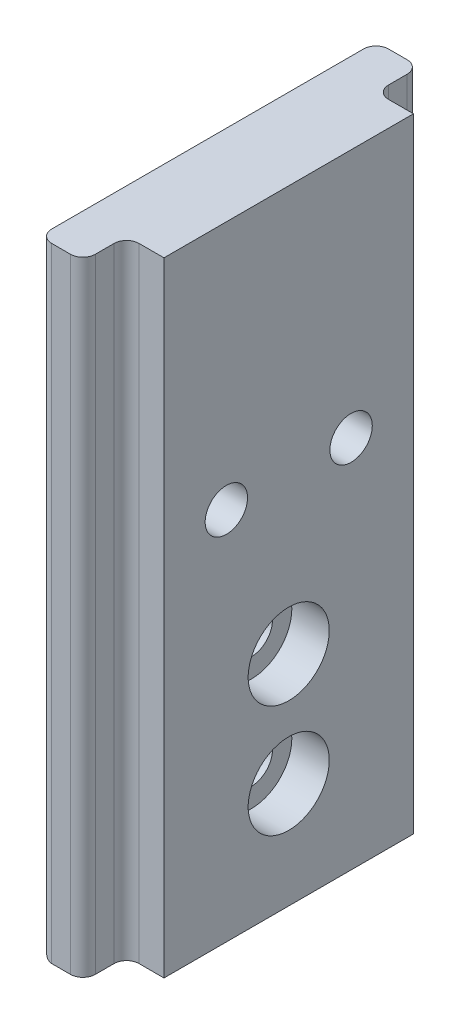
ISO-10303-21;
HEADER;
FILE_DESCRIPTION(('STEP AP214'),'2;1');
FILE_NAME('part.step','',(''),(''),'','','');
FILE_SCHEMA(('AUTOMOTIVE_DESIGN { 1 0 10303 214 1 1 1 1 }'));
ENDSEC;
DATA;
#1=APPLICATION_CONTEXT('core data for automotive mechanical design processes');
#2=APPLICATION_PROTOCOL_DEFINITION('international standard','automotive_design',2000,#1);
#3=PRODUCT_CONTEXT('',#1,'mechanical');
#4=PRODUCT('Part','Part','',(#3));
#5=PRODUCT_RELATED_PRODUCT_CATEGORY('part','',(#4));
#6=PRODUCT_DEFINITION_FORMATION('','',#4);
#7=PRODUCT_DEFINITION_CONTEXT('part definition',#1,'design');
#8=PRODUCT_DEFINITION('design','',#6,#7);
#9=PRODUCT_DEFINITION_SHAPE('','',#8);
#10=(LENGTH_UNIT() NAMED_UNIT(*) SI_UNIT(.MILLI.,.METRE.));
#11=(NAMED_UNIT(*) PLANE_ANGLE_UNIT() SI_UNIT($,.RADIAN.));
#12=(NAMED_UNIT(*) SI_UNIT($,.STERADIAN.) SOLID_ANGLE_UNIT());
#13=UNCERTAINTY_MEASURE_WITH_UNIT(LENGTH_MEASURE(1.E-05),#10,'distance_accuracy_value','');
#14=(GEOMETRIC_REPRESENTATION_CONTEXT(3) GLOBAL_UNCERTAINTY_ASSIGNED_CONTEXT((#13)) GLOBAL_UNIT_ASSIGNED_CONTEXT((#10,
#11,#12)) REPRESENTATION_CONTEXT('',''));
#15=CARTESIAN_POINT('',(0.,0.,0.));
#16=DIRECTION('',(0.,0.,1.));
#17=DIRECTION('',(1.,0.,0.));
#18=AXIS2_PLACEMENT_3D('',#15,#16,#17);
#19=CARTESIAN_POINT('',(0.,0.,0.));
#20=DIRECTION('',(1.,0.,0.));
#21=DIRECTION('',(0.,0.,-1.));
#22=AXIS2_PLACEMENT_3D('',#19,#20,#21);
#23=PLANE('',#22);
#24=CARTESIAN_POINT('',(0.,0.,-5.));
#25=DIRECTION('',(1.,0.,0.));
#26=DIRECTION('',(0.,0.,-1.));
#27=AXIS2_PLACEMENT_3D('',#24,#25,#26);
#28=CIRCLE('',#27,1.7);
#29=CARTESIAN_POINT('',(0.,0.,-6.7));
#30=VERTEX_POINT('',#29);
#31=EDGE_CURVE('E43',#30,#30,#28,.F.);
#32=ORIENTED_EDGE('',*,*,#31,.T.);
#33=EDGE_LOOP('',(#32));
#34=FACE_BOUND('',#33,.T.);
#35=CARTESIAN_POINT('',(0.,0.,4.99999999999999));
#36=DIRECTION('',(1.,0.,0.));
#37=DIRECTION('',(0.,0.,-1.));
#38=AXIS2_PLACEMENT_3D('',#35,#36,#37);
#39=CIRCLE('',#38,1.7);
#40=CARTESIAN_POINT('',(0.,0.,3.3));
#41=VERTEX_POINT('',#40);
#42=EDGE_CURVE('E187',#41,#41,#39,.F.);
#43=ORIENTED_EDGE('',*,*,#42,.T.);
#44=EDGE_LOOP('',(#43));
#45=FACE_BOUND('',#44,.T.);
#46=DIRECTION('',(0.,1.,0.));
#47=VECTOR('',#46,1.);
#48=CARTESIAN_POINT('',(0.,-30.,10.));
#49=LINE('',#48,#47);
#50=CARTESIAN_POINT('',(0.,-30.,10.));
#51=VERTEX_POINT('',#50);
#52=CARTESIAN_POINT('',(0.,20.,10.));
#53=VERTEX_POINT('',#52);
#54=EDGE_CURVE('E228',#51,#53,#49,.T.);
#55=ORIENTED_EDGE('',*,*,#54,.F.);
#56=DIRECTION('',(0.,0.,-1.));
#57=VECTOR('',#56,1.);
#58=CARTESIAN_POINT('',(0.,-30.,-10.));
#59=LINE('',#58,#57);
#60=CARTESIAN_POINT('',(0.,-30.,-10.));
#61=VERTEX_POINT('',#60);
#62=EDGE_CURVE('E234',#51,#61,#59,.T.);
#63=ORIENTED_EDGE('',*,*,#62,.T.);
#64=DIRECTION('',(0.,1.,0.));
#65=VECTOR('',#64,1.);
#66=CARTESIAN_POINT('',(0.,-30.,-10.));
#67=LINE('',#66,#65);
#68=CARTESIAN_POINT('',(0.,20.,-10.));
#69=VERTEX_POINT('',#68);
#70=EDGE_CURVE('E64',#61,#69,#67,.T.);
#71=ORIENTED_EDGE('',*,*,#70,.T.);
#72=DIRECTION('',(0.,0.,-1.));
#73=VECTOR('',#72,1.);
#74=CARTESIAN_POINT('',(0.,20.,-10.));
#75=LINE('',#74,#73);
#76=EDGE_CURVE('E248',#53,#69,#75,.T.);
#77=ORIENTED_EDGE('',*,*,#76,.F.);
#78=EDGE_LOOP('',(#55,#63,#71,#77));
#79=FACE_BOUND('',#78,.T.);
#80=CARTESIAN_POINT('',(0.,-12.5,0.));
#81=DIRECTION('',(1.,0.,0.));
#82=DIRECTION('',(0.,0.,-1.));
#83=AXIS2_PLACEMENT_3D('',#80,#81,#82);
#84=CIRCLE('',#83,3.25);
#85=CARTESIAN_POINT('',(0.,-12.5,-3.25));
#86=VERTEX_POINT('',#85);
#87=EDGE_CURVE('E286',#86,#86,#84,.T.);
#88=ORIENTED_EDGE('',*,*,#87,.F.);
#89=EDGE_LOOP('',(#88));
#90=FACE_BOUND('',#89,.T.);
#91=CARTESIAN_POINT('',(0.,-21.5,0.));
#92=DIRECTION('',(1.,0.,0.));
#93=DIRECTION('',(0.,0.,-1.));
#94=AXIS2_PLACEMENT_3D('',#91,#92,#93);
#95=CIRCLE('',#94,3.25);
#96=CARTESIAN_POINT('',(0.,-21.5,-3.25));
#97=VERTEX_POINT('',#96);
#98=EDGE_CURVE('E274',#97,#97,#95,.T.);
#99=ORIENTED_EDGE('',*,*,#98,.F.);
#100=EDGE_LOOP('',(#99));
#101=FACE_BOUND('',#100,.T.);
#102=ADVANCED_FACE('F39',(#34,#45,#79,#90,#101),#23,.T.);
#103=CARTESIAN_POINT('',(0.,-21.5,0.));
#104=DIRECTION('',(1.,0.,0.));
#105=DIRECTION('',(0.,0.,-1.));
#106=AXIS2_PLACEMENT_3D('',#103,#104,#105);
#107=CYLINDRICAL_SURFACE('',#106,1.70000000000001);
#108=CARTESIAN_POINT('',(-6.50000000000001,-21.5,0.));
#109=DIRECTION('',(1.,0.,0.));
#110=DIRECTION('',(0.,0.,-1.));
#111=AXIS2_PLACEMENT_3D('',#108,#109,#110);
#112=CIRCLE('',#111,1.7);
#113=CARTESIAN_POINT('',(-6.50000000000001,-21.5,-1.7));
#114=VERTEX_POINT('',#113);
#115=EDGE_CURVE('E265',#114,#114,#112,.T.);
#116=ORIENTED_EDGE('',*,*,#115,.F.);
#117=EDGE_LOOP('',(#116));
#118=FACE_BOUND('',#117,.T.);
#119=CARTESIAN_POINT('',(-3.,-21.5,0.));
#120=DIRECTION('',(1.,0.,0.));
#121=DIRECTION('',(0.,0.,-1.));
#122=AXIS2_PLACEMENT_3D('',#119,#120,#121);
#123=CIRCLE('',#122,1.70000000000001);
#124=CARTESIAN_POINT('',(-3.,-21.5,-1.70000000000001));
#125=VERTEX_POINT('',#124);
#126=EDGE_CURVE('E268',#125,#125,#123,.T.);
#127=ORIENTED_EDGE('',*,*,#126,.T.);
#128=EDGE_LOOP('',(#127));
#129=FACE_BOUND('',#128,.T.);
#130=ADVANCED_FACE('F324',(#118,#129),#107,.F.);
#131=CARTESIAN_POINT('',(-3.,-19.8,0.));
#132=DIRECTION('',(-1.,0.,0.));
#133=DIRECTION('',(0.,0.,1.));
#134=AXIS2_PLACEMENT_3D('',#131,#132,#133);
#135=PLANE('',#134);
#136=ORIENTED_EDGE('',*,*,#126,.F.);
#137=EDGE_LOOP('',(#136));
#138=FACE_BOUND('',#137,.T.);
#139=CARTESIAN_POINT('',(-3.,-21.5,0.));
#140=DIRECTION('',(1.,0.,0.));
#141=DIRECTION('',(0.,0.,-1.));
#142=AXIS2_PLACEMENT_3D('',#139,#140,#141);
#143=CIRCLE('',#142,3.25);
#144=CARTESIAN_POINT('',(-3.,-21.5,-3.25));
#145=VERTEX_POINT('',#144);
#146=EDGE_CURVE('E271',#145,#145,#143,.T.);
#147=ORIENTED_EDGE('',*,*,#146,.T.);
#148=EDGE_LOOP('',(#147));
#149=FACE_BOUND('',#148,.T.);
#150=ADVANCED_FACE('F326',(#138,#149),#135,.F.);
#151=CARTESIAN_POINT('',(0.,-21.5,0.));
#152=DIRECTION('',(1.,0.,0.));
#153=DIRECTION('',(0.,0.,-1.));
#154=AXIS2_PLACEMENT_3D('',#151,#152,#153);
#155=CYLINDRICAL_SURFACE('',#154,3.25);
#156=ORIENTED_EDGE('',*,*,#146,.F.);
#157=EDGE_LOOP('',(#156));
#158=FACE_BOUND('',#157,.T.);
#159=ORIENTED_EDGE('',*,*,#98,.T.);
#160=EDGE_LOOP('',(#159));
#161=FACE_BOUND('',#160,.T.);
#162=ADVANCED_FACE('F333',(#158,#161),#155,.F.);
#163=CARTESIAN_POINT('',(0.,-12.5,0.));
#164=DIRECTION('',(1.,0.,0.));
#165=DIRECTION('',(0.,0.,-1.));
#166=AXIS2_PLACEMENT_3D('',#163,#164,#165);
#167=CYLINDRICAL_SURFACE('',#166,1.70000000000001);
#168=CARTESIAN_POINT('',(-6.50000000000001,-12.5,0.));
#169=DIRECTION('',(1.,0.,0.));
#170=DIRECTION('',(0.,0.,-1.));
#171=AXIS2_PLACEMENT_3D('',#168,#169,#170);
#172=CIRCLE('',#171,1.7);
#173=CARTESIAN_POINT('',(-6.50000000000001,-12.5,-1.7));
#174=VERTEX_POINT('',#173);
#175=EDGE_CURVE('E277',#174,#174,#172,.T.);
#176=ORIENTED_EDGE('',*,*,#175,.F.);
#177=EDGE_LOOP('',(#176));
#178=FACE_BOUND('',#177,.T.);
#179=CARTESIAN_POINT('',(-3.,-12.5,0.));
#180=DIRECTION('',(1.,0.,0.));
#181=DIRECTION('',(0.,0.,-1.));
#182=AXIS2_PLACEMENT_3D('',#179,#180,#181);
#183=CIRCLE('',#182,1.70000000000001);
#184=CARTESIAN_POINT('',(-3.,-12.5,-1.70000000000001));
#185=VERTEX_POINT('',#184);
#186=EDGE_CURVE('E280',#185,#185,#183,.T.);
#187=ORIENTED_EDGE('',*,*,#186,.T.);
#188=EDGE_LOOP('',(#187));
#189=FACE_BOUND('',#188,.T.);
#190=ADVANCED_FACE('F344',(#178,#189),#167,.F.);
#191=CARTESIAN_POINT('',(-3.,-10.8,0.));
#192=DIRECTION('',(-1.,0.,0.));
#193=DIRECTION('',(0.,0.,1.));
#194=AXIS2_PLACEMENT_3D('',#191,#192,#193);
#195=PLANE('',#194);
#196=ORIENTED_EDGE('',*,*,#186,.F.);
#197=EDGE_LOOP('',(#196));
#198=FACE_BOUND('',#197,.T.);
#199=CARTESIAN_POINT('',(-3.,-12.5,0.));
#200=DIRECTION('',(1.,0.,0.));
#201=DIRECTION('',(0.,0.,-1.));
#202=AXIS2_PLACEMENT_3D('',#199,#200,#201);
#203=CIRCLE('',#202,3.25);
#204=CARTESIAN_POINT('',(-3.,-12.5,-3.25));
#205=VERTEX_POINT('',#204);
#206=EDGE_CURVE('E283',#205,#205,#203,.T.);
#207=ORIENTED_EDGE('',*,*,#206,.T.);
#208=EDGE_LOOP('',(#207));
#209=FACE_BOUND('',#208,.T.);
#210=ADVANCED_FACE('F348',(#198,#209),#195,.F.);
#211=CARTESIAN_POINT('',(0.,-12.5,0.));
#212=DIRECTION('',(1.,0.,0.));
#213=DIRECTION('',(0.,0.,-1.));
#214=AXIS2_PLACEMENT_3D('',#211,#212,#213);
#215=CYLINDRICAL_SURFACE('',#214,3.25);
#216=ORIENTED_EDGE('',*,*,#206,.F.);
#217=EDGE_LOOP('',(#216));
#218=FACE_BOUND('',#217,.T.);
#219=ORIENTED_EDGE('',*,*,#87,.T.);
#220=EDGE_LOOP('',(#219));
#221=FACE_BOUND('',#220,.T.);
#222=ADVANCED_FACE('F352',(#218,#221),#215,.F.);
#223=CARTESIAN_POINT('',(-6.5,0.,4.99999999999999));
#224=DIRECTION('',(-1.,0.,0.));
#225=DIRECTION('',(0.,0.,1.));
#226=AXIS2_PLACEMENT_3D('',#223,#224,#225);
#227=CYLINDRICAL_SURFACE('',#226,3.25);
#228=CARTESIAN_POINT('',(-3.5,0.,4.99999999999999));
#229=DIRECTION('',(-1.,0.,0.));
#230=DIRECTION('',(0.,0.,1.));
#231=AXIS2_PLACEMENT_3D('',#228,#229,#230);
#232=CIRCLE('',#231,3.25);
#233=CARTESIAN_POINT('',(-3.5,0.,8.24999999999999));
#234=VERTEX_POINT('',#233);
#235=EDGE_CURVE('E292',#234,#234,#232,.T.);
#236=ORIENTED_EDGE('',*,*,#235,.F.);
#237=EDGE_LOOP('',(#236));
#238=FACE_BOUND('',#237,.T.);
#239=CARTESIAN_POINT('',(-6.5,0.,4.99999999999999));
#240=DIRECTION('',(-1.,0.,0.));
#241=DIRECTION('',(0.,0.,1.));
#242=AXIS2_PLACEMENT_3D('',#239,#240,#241);
#243=CIRCLE('',#242,3.25);
#244=CARTESIAN_POINT('',(-6.5,0.,8.24999999999999));
#245=VERTEX_POINT('',#244);
#246=EDGE_CURVE('E295',#245,#245,#243,.T.);
#247=ORIENTED_EDGE('',*,*,#246,.T.);
#248=EDGE_LOOP('',(#247));
#249=FACE_BOUND('',#248,.T.);
#250=ADVANCED_FACE('F356',(#238,#249),#227,.F.);
#251=CARTESIAN_POINT('',(-3.5,1.7,4.99999999999999));
#252=DIRECTION('',(1.,0.,0.));
#253=DIRECTION('',(0.,0.,-1.));
#254=AXIS2_PLACEMENT_3D('',#251,#252,#253);
#255=PLANE('',#254);
#256=CARTESIAN_POINT('',(-3.5,0.,4.99999999999999));
#257=DIRECTION('',(-1.,0.,0.));
#258=DIRECTION('',(0.,0.,1.));
#259=AXIS2_PLACEMENT_3D('',#256,#257,#258);
#260=CIRCLE('',#259,1.7);
#261=CARTESIAN_POINT('',(-3.5,0.,6.69999999999999));
#262=VERTEX_POINT('',#261);
#263=EDGE_CURVE('E289',#262,#262,#260,.T.);
#264=ORIENTED_EDGE('',*,*,#263,.F.);
#265=EDGE_LOOP('',(#264));
#266=FACE_BOUND('',#265,.T.);
#267=ORIENTED_EDGE('',*,*,#235,.T.);
#268=EDGE_LOOP('',(#267));
#269=FACE_BOUND('',#268,.T.);
#270=ADVANCED_FACE('F358',(#266,#269),#255,.F.);
#271=CARTESIAN_POINT('',(-6.5,0.,4.99999999999999));
#272=DIRECTION('',(-1.,0.,0.));
#273=DIRECTION('',(0.,0.,1.));
#274=AXIS2_PLACEMENT_3D('',#271,#272,#273);
#275=CYLINDRICAL_SURFACE('',#274,1.7);
#276=ORIENTED_EDGE('',*,*,#263,.T.);
#277=EDGE_LOOP('',(#276));
#278=FACE_BOUND('',#277,.T.);
#279=ORIENTED_EDGE('',*,*,#42,.F.);
#280=EDGE_LOOP('',(#279));
#281=FACE_BOUND('',#280,.T.);
#282=ADVANCED_FACE('F361',(#278,#281),#275,.F.);
#283=CARTESIAN_POINT('',(-6.5,0.,-5.));
#284=DIRECTION('',(-1.,0.,0.));
#285=DIRECTION('',(0.,0.,1.));
#286=AXIS2_PLACEMENT_3D('',#283,#284,#285);
#287=CYLINDRICAL_SURFACE('',#286,3.25);
#288=CARTESIAN_POINT('',(-3.5,0.,-5.));
#289=DIRECTION('',(-1.,0.,0.));
#290=DIRECTION('',(0.,0.,1.));
#291=AXIS2_PLACEMENT_3D('',#288,#289,#290);
#292=CIRCLE('',#291,3.25);
#293=CARTESIAN_POINT('',(-3.5,0.,-1.75));
#294=VERTEX_POINT('',#293);
#295=EDGE_CURVE('E181',#294,#294,#292,.T.);
#296=ORIENTED_EDGE('',*,*,#295,.F.);
#297=EDGE_LOOP('',(#296));
#298=FACE_BOUND('',#297,.T.);
#299=CARTESIAN_POINT('',(-6.5,0.,-5.));
#300=DIRECTION('',(-1.,0.,0.));
#301=DIRECTION('',(0.,0.,1.));
#302=AXIS2_PLACEMENT_3D('',#299,#300,#301);
#303=CIRCLE('',#302,3.25);
#304=CARTESIAN_POINT('',(-6.5,0.,-1.75));
#305=VERTEX_POINT('',#304);
#306=EDGE_CURVE('E178',#305,#305,#303,.T.);
#307=ORIENTED_EDGE('',*,*,#306,.T.);
#308=EDGE_LOOP('',(#307));
#309=FACE_BOUND('',#308,.T.);
#310=ADVANCED_FACE('F319',(#298,#309),#287,.F.);
#311=CARTESIAN_POINT('',(-3.5,1.7,-5.));
#312=DIRECTION('',(1.,0.,0.));
#313=DIRECTION('',(0.,0.,-1.));
#314=AXIS2_PLACEMENT_3D('',#311,#312,#313);
#315=PLANE('',#314);
#316=CARTESIAN_POINT('',(-3.5,0.,-5.));
#317=DIRECTION('',(-1.,0.,0.));
#318=DIRECTION('',(0.,0.,1.));
#319=AXIS2_PLACEMENT_3D('',#316,#317,#318);
#320=CIRCLE('',#319,1.7);
#321=CARTESIAN_POINT('',(-3.5,0.,-3.3));
#322=VERTEX_POINT('',#321);
#323=EDGE_CURVE('E298',#322,#322,#320,.T.);
#324=ORIENTED_EDGE('',*,*,#323,.F.);
#325=EDGE_LOOP('',(#324));
#326=FACE_BOUND('',#325,.T.);
#327=ORIENTED_EDGE('',*,*,#295,.T.);
#328=EDGE_LOOP('',(#327));
#329=FACE_BOUND('',#328,.T.);
#330=ADVANCED_FACE('F311',(#326,#329),#315,.F.);
#331=CARTESIAN_POINT('',(-6.5,0.,-5.));
#332=DIRECTION('',(-1.,0.,0.));
#333=DIRECTION('',(0.,0.,1.));
#334=AXIS2_PLACEMENT_3D('',#331,#332,#333);
#335=CYLINDRICAL_SURFACE('',#334,1.7);
#336=ORIENTED_EDGE('',*,*,#323,.T.);
#337=EDGE_LOOP('',(#336));
#338=FACE_BOUND('',#337,.T.);
#339=ORIENTED_EDGE('',*,*,#31,.F.);
#340=EDGE_LOOP('',(#339));
#341=FACE_BOUND('',#340,.T.);
#342=ADVANCED_FACE('F309',(#338,#341),#335,.F.);
#343=CARTESIAN_POINT('',(-5.5,-29.,-13.5));
#344=DIRECTION('',(0.,0.,-1.));
#345=DIRECTION('',(-1.,0.,0.));
#346=AXIS2_PLACEMENT_3D('',#343,#344,#345);
#347=CYLINDRICAL_SURFACE('',#346,1.);
#348=CARTESIAN_POINT('',(-5.5,-29.,-12.5));
#349=DIRECTION('',(0.,0.707106781186547,-0.707106781186547));
#350=DIRECTION('',(0.,0.707106781186547,0.707106781186547));
#351=AXIS2_PLACEMENT_3D('',#348,#349,#350);
#352=ELLIPSE('',#351,1.41421356237309,1.);
#353=CARTESIAN_POINT('',(-6.5,-29.,-12.5));
#354=VERTEX_POINT('',#353);
#355=CARTESIAN_POINT('',(-5.5,-30.,-13.5));
#356=VERTEX_POINT('',#355);
#357=EDGE_CURVE('E48',#354,#356,#352,.F.);
#358=ORIENTED_EDGE('',*,*,#357,.T.);
#359=DIRECTION('',(0.,0.,1.));
#360=VECTOR('',#359,1.);
#361=CARTESIAN_POINT('',(-5.5,-30.,-13.5));
#362=LINE('',#361,#360);
#363=CARTESIAN_POINT('',(-5.50000000000001,-30.,13.5));
#364=VERTEX_POINT('',#363);
#365=EDGE_CURVE('E144',#364,#356,#362,.F.);
#366=ORIENTED_EDGE('',*,*,#365,.F.);
#367=CARTESIAN_POINT('',(-5.50000000000001,-29.,12.5));
#368=DIRECTION('',(0.,-0.707106781186547,-0.707106781186547));
#369=DIRECTION('',(0.,0.707106781186547,-0.707106781186547));
#370=AXIS2_PLACEMENT_3D('',#367,#368,#369);
#371=ELLIPSE('',#370,1.41421356237309,1.);
#372=CARTESIAN_POINT('',(-6.50000000000001,-29.,12.5));
#373=VERTEX_POINT('',#372);
#374=EDGE_CURVE('E11',#373,#364,#371,.F.);
#375=ORIENTED_EDGE('',*,*,#374,.F.);
#376=DIRECTION('',(0.,0.,1.));
#377=VECTOR('',#376,1.);
#378=CARTESIAN_POINT('',(-6.50000000000001,-29.,13.5));
#379=LINE('',#378,#377);
#380=EDGE_CURVE('E177',#354,#373,#379,.T.);
#381=ORIENTED_EDGE('',*,*,#380,.F.);
#382=EDGE_LOOP('',(#358,#366,#375,#381));
#383=FACE_BOUND('',#382,.T.);
#384=ADVANCED_FACE('F176',(#383),#347,.T.);
#385=CARTESIAN_POINT('',(-5.5,-30.,-12.5));
#386=DIRECTION('',(0.,1.,0.));
#387=DIRECTION('',(0.,0.,1.));
#388=AXIS2_PLACEMENT_3D('',#385,#386,#387);
#389=CYLINDRICAL_SURFACE('',#388,1.);
#390=CARTESIAN_POINT('',(-5.5,20.,-12.5));
#391=DIRECTION('',(0.,1.,0.));
#392=DIRECTION('',(0.,0.,1.));
#393=AXIS2_PLACEMENT_3D('',#390,#391,#392);
#394=CIRCLE('',#393,1.);
#395=CARTESIAN_POINT('',(-5.5,20.,-13.5));
#396=VERTEX_POINT('',#395);
#397=CARTESIAN_POINT('',(-6.5,20.,-12.5));
#398=VERTEX_POINT('',#397);
#399=EDGE_CURVE('E173',#396,#398,#394,.T.);
#400=ORIENTED_EDGE('',*,*,#399,.F.);
#401=DIRECTION('',(0.,1.,0.));
#402=VECTOR('',#401,1.);
#403=CARTESIAN_POINT('',(-5.5,-30.,-13.5));
#404=LINE('',#403,#402);
#405=EDGE_CURVE('E161',#356,#396,#404,.T.);
#406=ORIENTED_EDGE('',*,*,#405,.F.);
#407=ORIENTED_EDGE('',*,*,#357,.F.);
#408=DIRECTION('',(0.,1.,0.));
#409=VECTOR('',#408,1.);
#410=CARTESIAN_POINT('',(-6.5,-30.,-12.5));
#411=LINE('',#410,#409);
#412=EDGE_CURVE('E221',#398,#354,#411,.F.);
#413=ORIENTED_EDGE('',*,*,#412,.F.);
#414=EDGE_LOOP('',(#400,#406,#407,#413));
#415=FACE_BOUND('',#414,.T.);
#416=ADVANCED_FACE('F170',(#415),#389,.T.);
#417=CARTESIAN_POINT('',(-3.,-30.,-13.5));
#418=DIRECTION('',(0.,0.,-1.));
#419=DIRECTION('',(-1.,0.,0.));
#420=AXIS2_PLACEMENT_3D('',#417,#418,#419);
#421=PLANE('',#420);
#422=DIRECTION('',(-1.,0.,0.));
#423=VECTOR('',#422,1.);
#424=CARTESIAN_POINT('',(-3.,20.,-13.5));
#425=LINE('',#424,#423);
#426=CARTESIAN_POINT('',(-4.,20.,-13.5));
#427=VERTEX_POINT('',#426);
#428=EDGE_CURVE('E260',#427,#396,#425,.T.);
#429=ORIENTED_EDGE('',*,*,#428,.F.);
#430=DIRECTION('',(0.,1.,0.));
#431=VECTOR('',#430,1.);
#432=CARTESIAN_POINT('',(-4.,-30.,-13.5));
#433=LINE('',#432,#431);
#434=CARTESIAN_POINT('',(-4.,-30.,-13.5));
#435=VERTEX_POINT('',#434);
#436=EDGE_CURVE('E164',#427,#435,#433,.F.);
#437=ORIENTED_EDGE('',*,*,#436,.T.);
#438=DIRECTION('',(-1.,0.,0.));
#439=VECTOR('',#438,1.);
#440=CARTESIAN_POINT('',(-3.,-30.,-13.5));
#441=LINE('',#440,#439);
#442=EDGE_CURVE('E147',#435,#356,#441,.T.);
#443=ORIENTED_EDGE('',*,*,#442,.T.);
#444=ORIENTED_EDGE('',*,*,#405,.T.);
#445=EDGE_LOOP('',(#429,#437,#443,#444));
#446=FACE_BOUND('',#445,.T.);
#447=ADVANCED_FACE('F160',(#446),#421,.T.);
#448=CARTESIAN_POINT('',(-4.,-30.,-12.5));
#449=DIRECTION('',(0.,1.,0.));
#450=DIRECTION('',(0.,0.,1.));
#451=AXIS2_PLACEMENT_3D('',#448,#449,#450);
#452=CYLINDRICAL_SURFACE('',#451,1.);
#453=CARTESIAN_POINT('',(-4.,-30.,-12.5));
#454=DIRECTION('',(0.,1.,0.));
#455=DIRECTION('',(0.,0.,1.));
#456=AXIS2_PLACEMENT_3D('',#453,#454,#455);
#457=CIRCLE('',#456,1.);
#458=CARTESIAN_POINT('',(-3.,-30.,-12.5));
#459=VERTEX_POINT('',#458);
#460=EDGE_CURVE('E154',#435,#459,#457,.F.);
#461=ORIENTED_EDGE('',*,*,#460,.F.);
#462=ORIENTED_EDGE('',*,*,#436,.F.);
#463=CARTESIAN_POINT('',(-4.,20.,-12.5));
#464=DIRECTION('',(0.,1.,0.));
#465=DIRECTION('',(0.,0.,1.));
#466=AXIS2_PLACEMENT_3D('',#463,#464,#465);
#467=CIRCLE('',#466,1.);
#468=CARTESIAN_POINT('',(-3.,20.,-12.5));
#469=VERTEX_POINT('',#468);
#470=EDGE_CURVE('E212',#469,#427,#467,.T.);
#471=ORIENTED_EDGE('',*,*,#470,.F.);
#472=DIRECTION('',(0.,1.,0.));
#473=VECTOR('',#472,1.);
#474=CARTESIAN_POINT('',(-3.,-30.,-12.5));
#475=LINE('',#474,#473);
#476=EDGE_CURVE('E155',#459,#469,#475,.T.);
#477=ORIENTED_EDGE('',*,*,#476,.F.);
#478=EDGE_LOOP('',(#461,#462,#471,#477));
#479=FACE_BOUND('',#478,.T.);
#480=ADVANCED_FACE('F426',(#479),#452,.T.);
#481=CARTESIAN_POINT('',(-3.,-30.,-10.));
#482=DIRECTION('',(1.,0.,0.));
#483=DIRECTION('',(0.,0.,-1.));
#484=AXIS2_PLACEMENT_3D('',#481,#482,#483);
#485=PLANE('',#484);
#486=DIRECTION('',(0.,0.,-1.));
#487=VECTOR('',#486,1.);
#488=CARTESIAN_POINT('',(-3.,20.,-10.));
#489=LINE('',#488,#487);
#490=CARTESIAN_POINT('',(-3.,20.,-11.));
#491=VERTEX_POINT('',#490);
#492=EDGE_CURVE('E262',#491,#469,#489,.T.);
#493=ORIENTED_EDGE('',*,*,#492,.F.);
#494=DIRECTION('',(0.,1.,0.));
#495=VECTOR('',#494,1.);
#496=CARTESIAN_POINT('',(-3.,-30.,-11.));
#497=LINE('',#496,#495);
#498=CARTESIAN_POINT('',(-3.,-30.,-11.));
#499=VERTEX_POINT('',#498);
#500=EDGE_CURVE('E174',#491,#499,#497,.F.);
#501=ORIENTED_EDGE('',*,*,#500,.T.);
#502=DIRECTION('',(0.,0.,-1.));
#503=VECTOR('',#502,1.);
#504=CARTESIAN_POINT('',(-3.,-30.,-10.));
#505=LINE('',#504,#503);
#506=EDGE_CURVE('E165',#499,#459,#505,.T.);
#507=ORIENTED_EDGE('',*,*,#506,.T.);
#508=ORIENTED_EDGE('',*,*,#476,.T.);
#509=EDGE_LOOP('',(#493,#501,#507,#508));
#510=FACE_BOUND('',#509,.T.);
#511=ADVANCED_FACE('F422',(#510),#485,.T.);
#512=CARTESIAN_POINT('',(-2.,0.,-11.));
#513=DIRECTION('',(0.,-1.,0.));
#514=DIRECTION('',(0.,0.,-1.));
#515=AXIS2_PLACEMENT_3D('',#512,#513,#514);
#516=CYLINDRICAL_SURFACE('',#515,1.);
#517=CARTESIAN_POINT('',(-2.,-30.,-11.));
#518=DIRECTION('',(0.,1.,0.));
#519=DIRECTION('',(0.,0.,1.));
#520=AXIS2_PLACEMENT_3D('',#517,#518,#519);
#521=CIRCLE('',#520,1.);
#522=CARTESIAN_POINT('',(-2.,-30.,-10.));
#523=VERTEX_POINT('',#522);
#524=EDGE_CURVE('E189',#499,#523,#521,.T.);
#525=ORIENTED_EDGE('',*,*,#524,.F.);
#526=ORIENTED_EDGE('',*,*,#500,.F.);
#527=CARTESIAN_POINT('',(-2.,20.,-11.));
#528=DIRECTION('',(0.,1.,0.));
#529=DIRECTION('',(0.,0.,1.));
#530=AXIS2_PLACEMENT_3D('',#527,#528,#529);
#531=CIRCLE('',#530,1.);
#532=CARTESIAN_POINT('',(-2.,20.,-10.));
#533=VERTEX_POINT('',#532);
#534=EDGE_CURVE('E191',#533,#491,#531,.F.);
#535=ORIENTED_EDGE('',*,*,#534,.F.);
#536=DIRECTION('',(0.,1.,0.));
#537=VECTOR('',#536,1.);
#538=CARTESIAN_POINT('',(-2.,20.,-10.));
#539=LINE('',#538,#537);
#540=EDGE_CURVE('E225',#523,#533,#539,.T.);
#541=ORIENTED_EDGE('',*,*,#540,.F.);
#542=EDGE_LOOP('',(#525,#526,#535,#541));
#543=FACE_BOUND('',#542,.T.);
#544=ADVANCED_FACE('F418',(#543),#516,.F.);
#545=CARTESIAN_POINT('',(0.,0.,-10.));
#546=DIRECTION('',(0.,0.,-1.));
#547=DIRECTION('',(-1.,0.,0.));
#548=AXIS2_PLACEMENT_3D('',#545,#546,#547);
#549=PLANE('',#548);
#550=ORIENTED_EDGE('',*,*,#70,.F.);
#551=DIRECTION('',(-1.,0.,0.));
#552=VECTOR('',#551,1.);
#553=CARTESIAN_POINT('',(-3.,-30.,-10.));
#554=LINE('',#553,#552);
#555=EDGE_CURVE('E230',#61,#523,#554,.T.);
#556=ORIENTED_EDGE('',*,*,#555,.T.);
#557=ORIENTED_EDGE('',*,*,#540,.T.);
#558=DIRECTION('',(-1.,0.,0.));
#559=VECTOR('',#558,1.);
#560=CARTESIAN_POINT('',(-3.,20.,-10.));
#561=LINE('',#560,#559);
#562=EDGE_CURVE('E245',#69,#533,#561,.T.);
#563=ORIENTED_EDGE('',*,*,#562,.F.);
#564=EDGE_LOOP('',(#550,#556,#557,#563));
#565=FACE_BOUND('',#564,.T.);
#566=ADVANCED_FACE('F41',(#565),#549,.T.);
#567=CARTESIAN_POINT('',(0.,0.,10.));
#568=DIRECTION('',(0.,0.,-1.));
#569=DIRECTION('',(-1.,0.,0.));
#570=AXIS2_PLACEMENT_3D('',#567,#568,#569);
#571=PLANE('',#570);
#572=DIRECTION('',(1.,0.,0.));
#573=VECTOR('',#572,1.);
#574=CARTESIAN_POINT('',(0.,-30.,10.));
#575=LINE('',#574,#573);
#576=CARTESIAN_POINT('',(-2.,-30.,10.));
#577=VERTEX_POINT('',#576);
#578=EDGE_CURVE('E236',#577,#51,#575,.T.);
#579=ORIENTED_EDGE('',*,*,#578,.T.);
#580=ORIENTED_EDGE('',*,*,#54,.T.);
#581=DIRECTION('',(1.,0.,0.));
#582=VECTOR('',#581,1.);
#583=CARTESIAN_POINT('',(0.,20.,10.));
#584=LINE('',#583,#582);
#585=CARTESIAN_POINT('',(-2.,20.,10.));
#586=VERTEX_POINT('',#585);
#587=EDGE_CURVE('E56',#586,#53,#584,.T.);
#588=ORIENTED_EDGE('',*,*,#587,.F.);
#589=DIRECTION('',(0.,1.,0.));
#590=VECTOR('',#589,1.);
#591=CARTESIAN_POINT('',(-2.,0.,10.));
#592=LINE('',#591,#590);
#593=EDGE_CURVE('E223',#586,#577,#592,.F.);
#594=ORIENTED_EDGE('',*,*,#593,.T.);
#595=EDGE_LOOP('',(#579,#580,#588,#594));
#596=FACE_BOUND('',#595,.T.);
#597=ADVANCED_FACE('F408',(#596),#571,.F.);
#598=CARTESIAN_POINT('',(-2.,-30.,11.));
#599=DIRECTION('',(0.,1.,0.));
#600=DIRECTION('',(0.,0.,1.));
#601=AXIS2_PLACEMENT_3D('',#598,#599,#600);
#602=CYLINDRICAL_SURFACE('',#601,1.);
#603=CARTESIAN_POINT('',(-2.,-30.,11.));
#604=DIRECTION('',(0.,1.,0.));
#605=DIRECTION('',(0.,0.,1.));
#606=AXIS2_PLACEMENT_3D('',#603,#604,#605);
#607=CIRCLE('',#606,1.);
#608=CARTESIAN_POINT('',(-3.,-30.,11.));
#609=VERTEX_POINT('',#608);
#610=EDGE_CURVE('E184',#577,#609,#607,.T.);
#611=ORIENTED_EDGE('',*,*,#610,.F.);
#612=ORIENTED_EDGE('',*,*,#593,.F.);
#613=CARTESIAN_POINT('',(-2.,20.,11.));
#614=DIRECTION('',(0.,1.,0.));
#615=DIRECTION('',(0.,0.,1.));
#616=AXIS2_PLACEMENT_3D('',#613,#614,#615);
#617=CIRCLE('',#616,1.);
#618=CARTESIAN_POINT('',(-3.,20.,11.));
#619=VERTEX_POINT('',#618);
#620=EDGE_CURVE('E186',#619,#586,#617,.F.);
#621=ORIENTED_EDGE('',*,*,#620,.F.);
#622=DIRECTION('',(0.,1.,0.));
#623=VECTOR('',#622,1.);
#624=CARTESIAN_POINT('',(-3.,-30.,11.));
#625=LINE('',#624,#623);
#626=EDGE_CURVE('E195',#609,#619,#625,.T.);
#627=ORIENTED_EDGE('',*,*,#626,.F.);
#628=EDGE_LOOP('',(#611,#612,#621,#627));
#629=FACE_BOUND('',#628,.T.);
#630=ADVANCED_FACE('F405',(#629),#602,.F.);
#631=CARTESIAN_POINT('',(-3.,-30.,13.5));
#632=DIRECTION('',(1.,0.,0.));
#633=DIRECTION('',(0.,0.,-1.));
#634=AXIS2_PLACEMENT_3D('',#631,#632,#633);
#635=PLANE('',#634);
#636=DIRECTION('',(0.,0.,-1.));
#637=VECTOR('',#636,1.);
#638=CARTESIAN_POINT('',(-3.,20.,13.5));
#639=LINE('',#638,#637);
#640=CARTESIAN_POINT('',(-3.,20.,12.5));
#641=VERTEX_POINT('',#640);
#642=EDGE_CURVE('E251',#641,#619,#639,.T.);
#643=ORIENTED_EDGE('',*,*,#642,.F.);
#644=DIRECTION('',(0.,1.,0.));
#645=VECTOR('',#644,1.);
#646=CARTESIAN_POINT('',(-3.,-30.,12.5));
#647=LINE('',#646,#645);
#648=CARTESIAN_POINT('',(-3.,-30.,12.5));
#649=VERTEX_POINT('',#648);
#650=EDGE_CURVE('E193',#641,#649,#647,.F.);
#651=ORIENTED_EDGE('',*,*,#650,.T.);
#652=DIRECTION('',(0.,0.,-1.));
#653=VECTOR('',#652,1.);
#654=CARTESIAN_POINT('',(-3.,-30.,13.5));
#655=LINE('',#654,#653);
#656=EDGE_CURVE('E239',#649,#609,#655,.T.);
#657=ORIENTED_EDGE('',*,*,#656,.T.);
#658=ORIENTED_EDGE('',*,*,#626,.T.);
#659=EDGE_LOOP('',(#643,#651,#657,#658));
#660=FACE_BOUND('',#659,.T.);
#661=ADVANCED_FACE('F400',(#660),#635,.T.);
#662=CARTESIAN_POINT('',(-4.,-30.,12.5));
#663=DIRECTION('',(0.,1.,0.));
#664=DIRECTION('',(0.,0.,1.));
#665=AXIS2_PLACEMENT_3D('',#662,#663,#664);
#666=CYLINDRICAL_SURFACE('',#665,1.);
#667=CARTESIAN_POINT('',(-4.,-30.,12.5));
#668=DIRECTION('',(0.,1.,0.));
#669=DIRECTION('',(0.,0.,1.));
#670=AXIS2_PLACEMENT_3D('',#667,#668,#669);
#671=CIRCLE('',#670,1.);
#672=CARTESIAN_POINT('',(-4.,-30.,13.5));
#673=VERTEX_POINT('',#672);
#674=EDGE_CURVE('E203',#649,#673,#671,.F.);
#675=ORIENTED_EDGE('',*,*,#674,.F.);
#676=ORIENTED_EDGE('',*,*,#650,.F.);
#677=CARTESIAN_POINT('',(-4.,20.,12.5));
#678=DIRECTION('',(0.,1.,0.));
#679=DIRECTION('',(0.,0.,1.));
#680=AXIS2_PLACEMENT_3D('',#677,#678,#679);
#681=CIRCLE('',#680,1.);
#682=CARTESIAN_POINT('',(-4.,20.,13.5));
#683=VERTEX_POINT('',#682);
#684=EDGE_CURVE('E215',#683,#641,#681,.T.);
#685=ORIENTED_EDGE('',*,*,#684,.F.);
#686=DIRECTION('',(0.,1.,0.));
#687=VECTOR('',#686,1.);
#688=CARTESIAN_POINT('',(-4.,-30.,13.5));
#689=LINE('',#688,#687);
#690=EDGE_CURVE('E207',#673,#683,#689,.T.);
#691=ORIENTED_EDGE('',*,*,#690,.F.);
#692=EDGE_LOOP('',(#675,#676,#685,#691));
#693=FACE_BOUND('',#692,.T.);
#694=ADVANCED_FACE('F396',(#693),#666,.T.);
#695=CARTESIAN_POINT('',(-6.50000000000001,-30.,13.5));
#696=DIRECTION('',(0.,0.,1.));
#697=DIRECTION('',(1.,0.,0.));
#698=AXIS2_PLACEMENT_3D('',#695,#696,#697);
#699=PLANE('',#698);
#700=DIRECTION('',(1.,0.,0.));
#701=VECTOR('',#700,1.);
#702=CARTESIAN_POINT('',(-6.50000000000001,20.,13.5));
#703=LINE('',#702,#701);
#704=CARTESIAN_POINT('',(-5.50000000000001,20.,13.5));
#705=VERTEX_POINT('',#704);
#706=EDGE_CURVE('E254',#705,#683,#703,.T.);
#707=ORIENTED_EDGE('',*,*,#706,.F.);
#708=DIRECTION('',(0.,1.,0.));
#709=VECTOR('',#708,1.);
#710=CARTESIAN_POINT('',(-5.50000000000001,-30.,13.5));
#711=LINE('',#710,#709);
#712=EDGE_CURVE('E205',#705,#364,#711,.F.);
#713=ORIENTED_EDGE('',*,*,#712,.T.);
#714=DIRECTION('',(1.,0.,0.));
#715=VECTOR('',#714,1.);
#716=CARTESIAN_POINT('',(-6.50000000000001,-30.,13.5));
#717=LINE('',#716,#715);
#718=EDGE_CURVE('E150',#364,#673,#717,.T.);
#719=ORIENTED_EDGE('',*,*,#718,.T.);
#720=ORIENTED_EDGE('',*,*,#690,.T.);
#721=EDGE_LOOP('',(#707,#713,#719,#720));
#722=FACE_BOUND('',#721,.T.);
#723=ADVANCED_FACE('F392',(#722),#699,.T.);
#724=CARTESIAN_POINT('',(-5.50000000000001,-30.,12.5));
#725=DIRECTION('',(0.,1.,0.));
#726=DIRECTION('',(0.,0.,1.));
#727=AXIS2_PLACEMENT_3D('',#724,#725,#726);
#728=CYLINDRICAL_SURFACE('',#727,1.);
#729=ORIENTED_EDGE('',*,*,#374,.T.);
#730=ORIENTED_EDGE('',*,*,#712,.F.);
#731=CARTESIAN_POINT('',(-5.50000000000001,20.,12.5));
#732=DIRECTION('',(0.,1.,0.));
#733=DIRECTION('',(0.,0.,1.));
#734=AXIS2_PLACEMENT_3D('',#731,#732,#733);
#735=CIRCLE('',#734,1.);
#736=CARTESIAN_POINT('',(-6.50000000000001,20.,12.5));
#737=VERTEX_POINT('',#736);
#738=EDGE_CURVE('E210',#737,#705,#735,.T.);
#739=ORIENTED_EDGE('',*,*,#738,.F.);
#740=DIRECTION('',(0.,1.,0.));
#741=VECTOR('',#740,1.);
#742=CARTESIAN_POINT('',(-6.50000000000001,-30.,12.5));
#743=LINE('',#742,#741);
#744=EDGE_CURVE('E217',#373,#737,#743,.T.);
#745=ORIENTED_EDGE('',*,*,#744,.F.);
#746=EDGE_LOOP('',(#729,#730,#739,#745));
#747=FACE_BOUND('',#746,.T.);
#748=ADVANCED_FACE('F379',(#747),#728,.T.);
#749=CARTESIAN_POINT('',(-6.5,-30.,-13.5));
#750=DIRECTION('',(-1.,0.,0.));
#751=DIRECTION('',(0.,0.,1.));
#752=AXIS2_PLACEMENT_3D('',#749,#750,#751);
#753=PLANE('',#752);
#754=ORIENTED_EDGE('',*,*,#306,.F.);
#755=EDGE_LOOP('',(#754));
#756=FACE_BOUND('',#755,.T.);
#757=ORIENTED_EDGE('',*,*,#246,.F.);
#758=EDGE_LOOP('',(#757));
#759=FACE_BOUND('',#758,.T.);
#760=ORIENTED_EDGE('',*,*,#175,.T.);
#761=EDGE_LOOP('',(#760));
#762=FACE_BOUND('',#761,.T.);
#763=ORIENTED_EDGE('',*,*,#115,.T.);
#764=EDGE_LOOP('',(#763));
#765=FACE_BOUND('',#764,.T.);
#766=ORIENTED_EDGE('',*,*,#380,.T.);
#767=ORIENTED_EDGE('',*,*,#744,.T.);
#768=DIRECTION('',(0.,0.,1.));
#769=VECTOR('',#768,1.);
#770=CARTESIAN_POINT('',(-6.5,20.,-13.5));
#771=LINE('',#770,#769);
#772=EDGE_CURVE('E257',#398,#737,#771,.T.);
#773=ORIENTED_EDGE('',*,*,#772,.F.);
#774=ORIENTED_EDGE('',*,*,#412,.T.);
#775=EDGE_LOOP('',(#766,#767,#773,#774));
#776=FACE_BOUND('',#775,.T.);
#777=ADVANCED_FACE('F376',(#756,#759,#762,#765,#776),#753,.T.);
#778=CARTESIAN_POINT('',(0.,20.,0.));
#779=DIRECTION('',(0.,1.,0.));
#780=DIRECTION('',(0.,0.,1.));
#781=AXIS2_PLACEMENT_3D('',#778,#779,#780);
#782=PLANE('',#781);
#783=ORIENTED_EDGE('',*,*,#772,.T.);
#784=ORIENTED_EDGE('',*,*,#738,.T.);
#785=ORIENTED_EDGE('',*,*,#706,.T.);
#786=ORIENTED_EDGE('',*,*,#684,.T.);
#787=ORIENTED_EDGE('',*,*,#642,.T.);
#788=ORIENTED_EDGE('',*,*,#620,.T.);
#789=ORIENTED_EDGE('',*,*,#587,.T.);
#790=ORIENTED_EDGE('',*,*,#76,.T.);
#791=ORIENTED_EDGE('',*,*,#562,.T.);
#792=ORIENTED_EDGE('',*,*,#534,.T.);
#793=ORIENTED_EDGE('',*,*,#492,.T.);
#794=ORIENTED_EDGE('',*,*,#470,.T.);
#795=ORIENTED_EDGE('',*,*,#428,.T.);
#796=ORIENTED_EDGE('',*,*,#399,.T.);
#797=EDGE_LOOP('',(#783,#784,#785,#786,#787,#788,#789,#790,#791,#792,#793,#794,#795,#796));
#798=FACE_BOUND('',#797,.T.);
#799=ADVANCED_FACE('F339',(#798),#782,.T.);
#800=CARTESIAN_POINT('',(0.,-30.,0.));
#801=DIRECTION('',(0.,1.,0.));
#802=DIRECTION('',(0.,0.,1.));
#803=AXIS2_PLACEMENT_3D('',#800,#801,#802);
#804=PLANE('',#803);
#805=ORIENTED_EDGE('',*,*,#718,.F.);
#806=ORIENTED_EDGE('',*,*,#365,.T.);
#807=ORIENTED_EDGE('',*,*,#442,.F.);
#808=ORIENTED_EDGE('',*,*,#460,.T.);
#809=ORIENTED_EDGE('',*,*,#506,.F.);
#810=ORIENTED_EDGE('',*,*,#524,.T.);
#811=ORIENTED_EDGE('',*,*,#555,.F.);
#812=ORIENTED_EDGE('',*,*,#62,.F.);
#813=ORIENTED_EDGE('',*,*,#578,.F.);
#814=ORIENTED_EDGE('',*,*,#610,.T.);
#815=ORIENTED_EDGE('',*,*,#656,.F.);
#816=ORIENTED_EDGE('',*,*,#674,.T.);
#817=EDGE_LOOP('',(#805,#806,#807,#808,#809,#810,#811,#812,#813,#814,#815,#816));
#818=FACE_BOUND('',#817,.T.);
#819=ADVANCED_FACE('F146',(#818),#804,.F.);
#820=CLOSED_SHELL('',(#102,#130,#150,#162,#190,#210,#222,#250,#270,#282,#310,#330,#342,#384,
#416,#447,#480,#511,#544,#566,#597,#630,#661,#694,#723,#748,#777,#799,#819));
#821=MANIFOLD_SOLID_BREP('B2',#820);
#822=ADVANCED_BREP_SHAPE_REPRESENTATION('',(#18,#821),#14);
#823=SHAPE_DEFINITION_REPRESENTATION(#9,#822);
ENDSEC;
END-ISO-10303-21;
